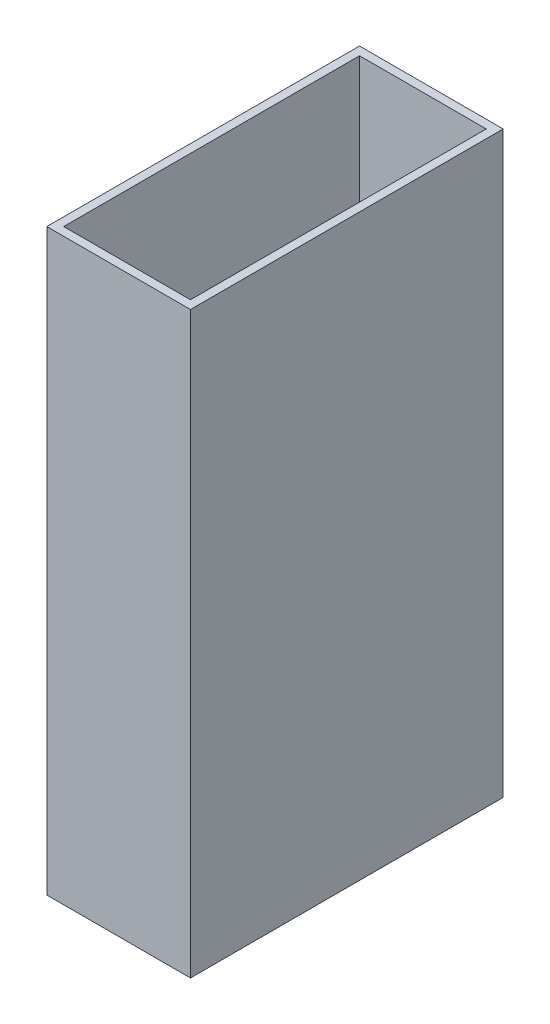
ISO-10303-21;
HEADER;
FILE_DESCRIPTION(('STEP AP214'),'2;1');
FILE_NAME('part.step','',(''),(''),'','','');
FILE_SCHEMA(('AUTOMOTIVE_DESIGN { 1 0 10303 214 1 1 1 1 }'));
ENDSEC;
DATA;
#1=APPLICATION_CONTEXT('core data for automotive mechanical design processes');
#2=APPLICATION_PROTOCOL_DEFINITION('international standard','automotive_design',2000,#1);
#3=PRODUCT_CONTEXT('',#1,'mechanical');
#4=PRODUCT('Part','Part','',(#3));
#5=PRODUCT_RELATED_PRODUCT_CATEGORY('part','',(#4));
#6=PRODUCT_DEFINITION_FORMATION('','',#4);
#7=PRODUCT_DEFINITION_CONTEXT('part definition',#1,'design');
#8=PRODUCT_DEFINITION('design','',#6,#7);
#9=PRODUCT_DEFINITION_SHAPE('','',#8);
#10=(LENGTH_UNIT() NAMED_UNIT(*) SI_UNIT(.MILLI.,.METRE.));
#11=(NAMED_UNIT(*) PLANE_ANGLE_UNIT() SI_UNIT($,.RADIAN.));
#12=(NAMED_UNIT(*) SI_UNIT($,.STERADIAN.) SOLID_ANGLE_UNIT());
#13=UNCERTAINTY_MEASURE_WITH_UNIT(LENGTH_MEASURE(1.E-05),#10,'distance_accuracy_value','');
#14=(GEOMETRIC_REPRESENTATION_CONTEXT(3) GLOBAL_UNCERTAINTY_ASSIGNED_CONTEXT((#13)) GLOBAL_UNIT_ASSIGNED_CONTEXT((#10,
#11,#12)) REPRESENTATION_CONTEXT('',''));
#15=CARTESIAN_POINT('',(0.,0.,0.));
#16=DIRECTION('',(0.,0.,1.));
#17=DIRECTION('',(1.,0.,0.));
#18=AXIS2_PLACEMENT_3D('',#15,#16,#17);
#19=CARTESIAN_POINT('',(0.,135.,0.));
#20=DIRECTION('',(0.,-1.,0.));
#21=DIRECTION('',(0.,0.,-1.));
#22=AXIS2_PLACEMENT_3D('',#19,#20,#21);
#23=PLANE('',#22);
#24=DIRECTION('',(0.,0.,1.));
#25=VECTOR('',#24,1.);
#26=CARTESIAN_POINT('',(-17.,135.,37.));
#27=LINE('',#26,#25);
#28=CARTESIAN_POINT('',(-17.,135.,-37.));
#29=VERTEX_POINT('',#28);
#30=CARTESIAN_POINT('',(-17.,135.,37.));
#31=VERTEX_POINT('',#30);
#32=EDGE_CURVE('E179',#29,#31,#27,.T.);
#33=ORIENTED_EDGE('',*,*,#32,.T.);
#34=DIRECTION('',(1.,0.,0.));
#35=VECTOR('',#34,1.);
#36=CARTESIAN_POINT('',(-17.,135.,37.));
#37=LINE('',#36,#35);
#38=CARTESIAN_POINT('',(17.,135.,37.));
#39=VERTEX_POINT('',#38);
#40=EDGE_CURVE('E117',#31,#39,#37,.T.);
#41=ORIENTED_EDGE('',*,*,#40,.T.);
#42=DIRECTION('',(0.,0.,-1.));
#43=VECTOR('',#42,1.);
#44=CARTESIAN_POINT('',(17.,135.,37.));
#45=LINE('',#44,#43);
#46=CARTESIAN_POINT('',(17.,135.,-37.));
#47=VERTEX_POINT('',#46);
#48=EDGE_CURVE('E184',#39,#47,#45,.T.);
#49=ORIENTED_EDGE('',*,*,#48,.T.);
#50=DIRECTION('',(-1.,0.,0.));
#51=VECTOR('',#50,1.);
#52=CARTESIAN_POINT('',(-17.,135.,-37.));
#53=LINE('',#52,#51);
#54=EDGE_CURVE('E187',#47,#29,#53,.T.);
#55=ORIENTED_EDGE('',*,*,#54,.T.);
#56=EDGE_LOOP('',(#33,#41,#49,#55));
#57=FACE_BOUND('',#56,.T.);
#58=DIRECTION('',(0.,0.,-1.));
#59=VECTOR('',#58,1.);
#60=CARTESIAN_POINT('',(15.,135.,35.));
#61=LINE('',#60,#59);
#62=CARTESIAN_POINT('',(15.,135.,35.));
#63=VERTEX_POINT('',#62);
#64=CARTESIAN_POINT('',(15.,135.,-35.));
#65=VERTEX_POINT('',#64);
#66=EDGE_CURVE('E142',#63,#65,#61,.T.);
#67=ORIENTED_EDGE('',*,*,#66,.F.);
#68=DIRECTION('',(1.,0.,0.));
#69=VECTOR('',#68,1.);
#70=CARTESIAN_POINT('',(-15.,135.,35.));
#71=LINE('',#70,#69);
#72=CARTESIAN_POINT('',(-15.,135.,35.));
#73=VERTEX_POINT('',#72);
#74=EDGE_CURVE('E152',#73,#63,#71,.T.);
#75=ORIENTED_EDGE('',*,*,#74,.F.);
#76=DIRECTION('',(0.,0.,1.));
#77=VECTOR('',#76,1.);
#78=CARTESIAN_POINT('',(-15.,135.,35.));
#79=LINE('',#78,#77);
#80=CARTESIAN_POINT('',(-15.,135.,-35.));
#81=VERTEX_POINT('',#80);
#82=EDGE_CURVE('E149',#81,#73,#79,.T.);
#83=ORIENTED_EDGE('',*,*,#82,.F.);
#84=DIRECTION('',(-1.,0.,0.));
#85=VECTOR('',#84,1.);
#86=CARTESIAN_POINT('',(-15.,135.,-35.));
#87=LINE('',#86,#85);
#88=EDGE_CURVE('E145',#65,#81,#87,.T.);
#89=ORIENTED_EDGE('',*,*,#88,.F.);
#90=EDGE_LOOP('',(#67,#75,#83,#89));
#91=FACE_BOUND('',#90,.T.);
#92=ADVANCED_FACE('F45',(#57,#91),#23,.F.);
#93=CARTESIAN_POINT('',(-17.,135.,37.));
#94=DIRECTION('',(1.,0.,0.));
#95=DIRECTION('',(0.,0.,-1.));
#96=AXIS2_PLACEMENT_3D('',#93,#94,#95);
#97=PLANE('',#96);
#98=DIRECTION('',(0.,-1.,0.));
#99=VECTOR('',#98,1.);
#100=CARTESIAN_POINT('',(-17.,135.,-37.));
#101=LINE('',#100,#99);
#102=CARTESIAN_POINT('',(-17.,-2.,-37.));
#103=VERTEX_POINT('',#102);
#104=EDGE_CURVE('E124',#29,#103,#101,.T.);
#105=ORIENTED_EDGE('',*,*,#104,.T.);
#106=DIRECTION('',(0.,0.,-1.));
#107=VECTOR('',#106,1.);
#108=CARTESIAN_POINT('',(-17.,-2.,0.));
#109=LINE('',#108,#107);
#110=CARTESIAN_POINT('',(-17.,-2.,37.));
#111=VERTEX_POINT('',#110);
#112=EDGE_CURVE('E122',#111,#103,#109,.T.);
#113=ORIENTED_EDGE('',*,*,#112,.F.);
#114=DIRECTION('',(0.,-1.,0.));
#115=VECTOR('',#114,1.);
#116=CARTESIAN_POINT('',(-17.,135.,37.));
#117=LINE('',#116,#115);
#118=EDGE_CURVE('E11',#31,#111,#117,.T.);
#119=ORIENTED_EDGE('',*,*,#118,.F.);
#120=ORIENTED_EDGE('',*,*,#32,.F.);
#121=EDGE_LOOP('',(#105,#113,#119,#120));
#122=FACE_BOUND('',#121,.T.);
#123=ADVANCED_FACE('F47',(#122),#97,.F.);
#124=CARTESIAN_POINT('',(-17.,135.,37.));
#125=DIRECTION('',(0.,0.,-1.));
#126=DIRECTION('',(-1.,0.,0.));
#127=AXIS2_PLACEMENT_3D('',#124,#125,#126);
#128=PLANE('',#127);
#129=ORIENTED_EDGE('',*,*,#118,.T.);
#130=DIRECTION('',(1.,0.,0.));
#131=VECTOR('',#130,1.);
#132=CARTESIAN_POINT('',(0.,-2.,37.));
#133=LINE('',#132,#131);
#134=CARTESIAN_POINT('',(17.,-2.,37.));
#135=VERTEX_POINT('',#134);
#136=EDGE_CURVE('E116',#111,#135,#133,.T.);
#137=ORIENTED_EDGE('',*,*,#136,.T.);
#138=DIRECTION('',(0.,-1.,0.));
#139=VECTOR('',#138,1.);
#140=CARTESIAN_POINT('',(17.,135.,37.));
#141=LINE('',#140,#139);
#142=EDGE_CURVE('E54',#39,#135,#141,.T.);
#143=ORIENTED_EDGE('',*,*,#142,.F.);
#144=ORIENTED_EDGE('',*,*,#40,.F.);
#145=EDGE_LOOP('',(#129,#137,#143,#144));
#146=FACE_BOUND('',#145,.T.);
#147=ADVANCED_FACE('F113',(#146),#128,.F.);
#148=CARTESIAN_POINT('',(17.,135.,37.));
#149=DIRECTION('',(-1.,0.,0.));
#150=DIRECTION('',(0.,0.,1.));
#151=AXIS2_PLACEMENT_3D('',#148,#149,#150);
#152=PLANE('',#151);
#153=ORIENTED_EDGE('',*,*,#142,.T.);
#154=DIRECTION('',(0.,0.,-1.));
#155=VECTOR('',#154,1.);
#156=CARTESIAN_POINT('',(17.,-2.,0.));
#157=LINE('',#156,#155);
#158=CARTESIAN_POINT('',(17.,-2.,-37.));
#159=VERTEX_POINT('',#158);
#160=EDGE_CURVE('E133',#135,#159,#157,.T.);
#161=ORIENTED_EDGE('',*,*,#160,.T.);
#162=DIRECTION('',(0.,-1.,0.));
#163=VECTOR('',#162,1.);
#164=CARTESIAN_POINT('',(17.,135.,-37.));
#165=LINE('',#164,#163);
#166=EDGE_CURVE('E192',#47,#159,#165,.T.);
#167=ORIENTED_EDGE('',*,*,#166,.F.);
#168=ORIENTED_EDGE('',*,*,#48,.F.);
#169=EDGE_LOOP('',(#153,#161,#167,#168));
#170=FACE_BOUND('',#169,.T.);
#171=ADVANCED_FACE('F197',(#170),#152,.F.);
#172=CARTESIAN_POINT('',(-17.,135.,-37.));
#173=DIRECTION('',(0.,0.,1.));
#174=DIRECTION('',(1.,0.,0.));
#175=AXIS2_PLACEMENT_3D('',#172,#173,#174);
#176=PLANE('',#175);
#177=ORIENTED_EDGE('',*,*,#166,.T.);
#178=DIRECTION('',(1.,0.,0.));
#179=VECTOR('',#178,1.);
#180=CARTESIAN_POINT('',(0.,-2.,-37.));
#181=LINE('',#180,#179);
#182=EDGE_CURVE('E137',#103,#159,#181,.T.);
#183=ORIENTED_EDGE('',*,*,#182,.F.);
#184=ORIENTED_EDGE('',*,*,#104,.F.);
#185=ORIENTED_EDGE('',*,*,#54,.F.);
#186=EDGE_LOOP('',(#177,#183,#184,#185));
#187=FACE_BOUND('',#186,.T.);
#188=ADVANCED_FACE('F203',(#187),#176,.F.);
#189=CARTESIAN_POINT('',(15.,135.,35.));
#190=DIRECTION('',(-1.,0.,0.));
#191=DIRECTION('',(0.,0.,1.));
#192=AXIS2_PLACEMENT_3D('',#189,#190,#191);
#193=PLANE('',#192);
#194=DIRECTION('',(0.,0.,-1.));
#195=VECTOR('',#194,1.);
#196=CARTESIAN_POINT('',(15.,0.,35.));
#197=LINE('',#196,#195);
#198=CARTESIAN_POINT('',(15.,0.,35.));
#199=VERTEX_POINT('',#198);
#200=CARTESIAN_POINT('',(15.,0.,-35.));
#201=VERTEX_POINT('',#200);
#202=EDGE_CURVE('E69',#199,#201,#197,.T.);
#203=ORIENTED_EDGE('',*,*,#202,.F.);
#204=DIRECTION('',(0.,-1.,0.));
#205=VECTOR('',#204,1.);
#206=CARTESIAN_POINT('',(15.,135.,35.));
#207=LINE('',#206,#205);
#208=EDGE_CURVE('E155',#63,#199,#207,.T.);
#209=ORIENTED_EDGE('',*,*,#208,.F.);
#210=ORIENTED_EDGE('',*,*,#66,.T.);
#211=DIRECTION('',(0.,-1.,0.));
#212=VECTOR('',#211,1.);
#213=CARTESIAN_POINT('',(15.,135.,-35.));
#214=LINE('',#213,#212);
#215=EDGE_CURVE('E176',#65,#201,#214,.T.);
#216=ORIENTED_EDGE('',*,*,#215,.T.);
#217=EDGE_LOOP('',(#203,#209,#210,#216));
#218=FACE_BOUND('',#217,.T.);
#219=ADVANCED_FACE('F205',(#218),#193,.T.);
#220=CARTESIAN_POINT('',(-15.,135.,-35.));
#221=DIRECTION('',(0.,0.,1.));
#222=DIRECTION('',(1.,0.,0.));
#223=AXIS2_PLACEMENT_3D('',#220,#221,#222);
#224=PLANE('',#223);
#225=DIRECTION('',(-1.,0.,0.));
#226=VECTOR('',#225,1.);
#227=CARTESIAN_POINT('',(-15.,0.,-35.));
#228=LINE('',#227,#226);
#229=CARTESIAN_POINT('',(-15.,0.,-35.));
#230=VERTEX_POINT('',#229);
#231=EDGE_CURVE('E158',#201,#230,#228,.T.);
#232=ORIENTED_EDGE('',*,*,#231,.F.);
#233=ORIENTED_EDGE('',*,*,#215,.F.);
#234=ORIENTED_EDGE('',*,*,#88,.T.);
#235=DIRECTION('',(0.,-1.,0.));
#236=VECTOR('',#235,1.);
#237=CARTESIAN_POINT('',(-15.,135.,-35.));
#238=LINE('',#237,#236);
#239=EDGE_CURVE('E173',#81,#230,#238,.T.);
#240=ORIENTED_EDGE('',*,*,#239,.T.);
#241=EDGE_LOOP('',(#232,#233,#234,#240));
#242=FACE_BOUND('',#241,.T.);
#243=ADVANCED_FACE('F211',(#242),#224,.T.);
#244=CARTESIAN_POINT('',(-15.,135.,35.));
#245=DIRECTION('',(1.,0.,0.));
#246=DIRECTION('',(0.,0.,-1.));
#247=AXIS2_PLACEMENT_3D('',#244,#245,#246);
#248=PLANE('',#247);
#249=DIRECTION('',(0.,0.,1.));
#250=VECTOR('',#249,1.);
#251=CARTESIAN_POINT('',(-15.,0.,35.));
#252=LINE('',#251,#250);
#253=CARTESIAN_POINT('',(-15.,0.,35.));
#254=VERTEX_POINT('',#253);
#255=EDGE_CURVE('E162',#230,#254,#252,.T.);
#256=ORIENTED_EDGE('',*,*,#255,.F.);
#257=ORIENTED_EDGE('',*,*,#239,.F.);
#258=ORIENTED_EDGE('',*,*,#82,.T.);
#259=DIRECTION('',(0.,-1.,0.));
#260=VECTOR('',#259,1.);
#261=CARTESIAN_POINT('',(-15.,135.,35.));
#262=LINE('',#261,#260);
#263=EDGE_CURVE('E61',#73,#254,#262,.T.);
#264=ORIENTED_EDGE('',*,*,#263,.T.);
#265=EDGE_LOOP('',(#256,#257,#258,#264));
#266=FACE_BOUND('',#265,.T.);
#267=ADVANCED_FACE('F222',(#266),#248,.T.);
#268=CARTESIAN_POINT('',(-15.,135.,35.));
#269=DIRECTION('',(0.,0.,-1.));
#270=DIRECTION('',(-1.,0.,0.));
#271=AXIS2_PLACEMENT_3D('',#268,#269,#270);
#272=PLANE('',#271);
#273=DIRECTION('',(1.,0.,0.));
#274=VECTOR('',#273,1.);
#275=CARTESIAN_POINT('',(-15.,0.,35.));
#276=LINE('',#275,#274);
#277=EDGE_CURVE('E146',#254,#199,#276,.T.);
#278=ORIENTED_EDGE('',*,*,#277,.F.);
#279=ORIENTED_EDGE('',*,*,#263,.F.);
#280=ORIENTED_EDGE('',*,*,#74,.T.);
#281=ORIENTED_EDGE('',*,*,#208,.T.);
#282=EDGE_LOOP('',(#278,#279,#280,#281));
#283=FACE_BOUND('',#282,.T.);
#284=ADVANCED_FACE('F226',(#283),#272,.T.);
#285=CARTESIAN_POINT('',(0.,0.,0.));
#286=DIRECTION('',(0.,1.,0.));
#287=DIRECTION('',(0.,0.,1.));
#288=AXIS2_PLACEMENT_3D('',#285,#286,#287);
#289=PLANE('',#288);
#290=ORIENTED_EDGE('',*,*,#255,.T.);
#291=ORIENTED_EDGE('',*,*,#277,.T.);
#292=ORIENTED_EDGE('',*,*,#202,.T.);
#293=ORIENTED_EDGE('',*,*,#231,.T.);
#294=EDGE_LOOP('',(#290,#291,#292,#293));
#295=FACE_BOUND('',#294,.T.);
#296=ADVANCED_FACE('F230',(#295),#289,.T.);
#297=CARTESIAN_POINT('',(0.,-2.,0.));
#298=DIRECTION('',(0.,1.,0.));
#299=DIRECTION('',(0.,0.,1.));
#300=AXIS2_PLACEMENT_3D('',#297,#298,#299);
#301=PLANE('',#300);
#302=ORIENTED_EDGE('',*,*,#112,.T.);
#303=ORIENTED_EDGE('',*,*,#182,.T.);
#304=ORIENTED_EDGE('',*,*,#160,.F.);
#305=ORIENTED_EDGE('',*,*,#136,.F.);
#306=EDGE_LOOP('',(#302,#303,#304,#305));
#307=FACE_BOUND('',#306,.T.);
#308=ADVANCED_FACE('F131',(#307),#301,.F.);
#309=CLOSED_SHELL('',(#92,#123,#147,#171,#188,#219,#243,#267,#284,#296,#308));
#310=MANIFOLD_SOLID_BREP('B2',#309);
#311=ADVANCED_BREP_SHAPE_REPRESENTATION('',(#18,#310),#14);
#312=SHAPE_DEFINITION_REPRESENTATION(#9,#311);
ENDSEC;
END-ISO-10303-21;
